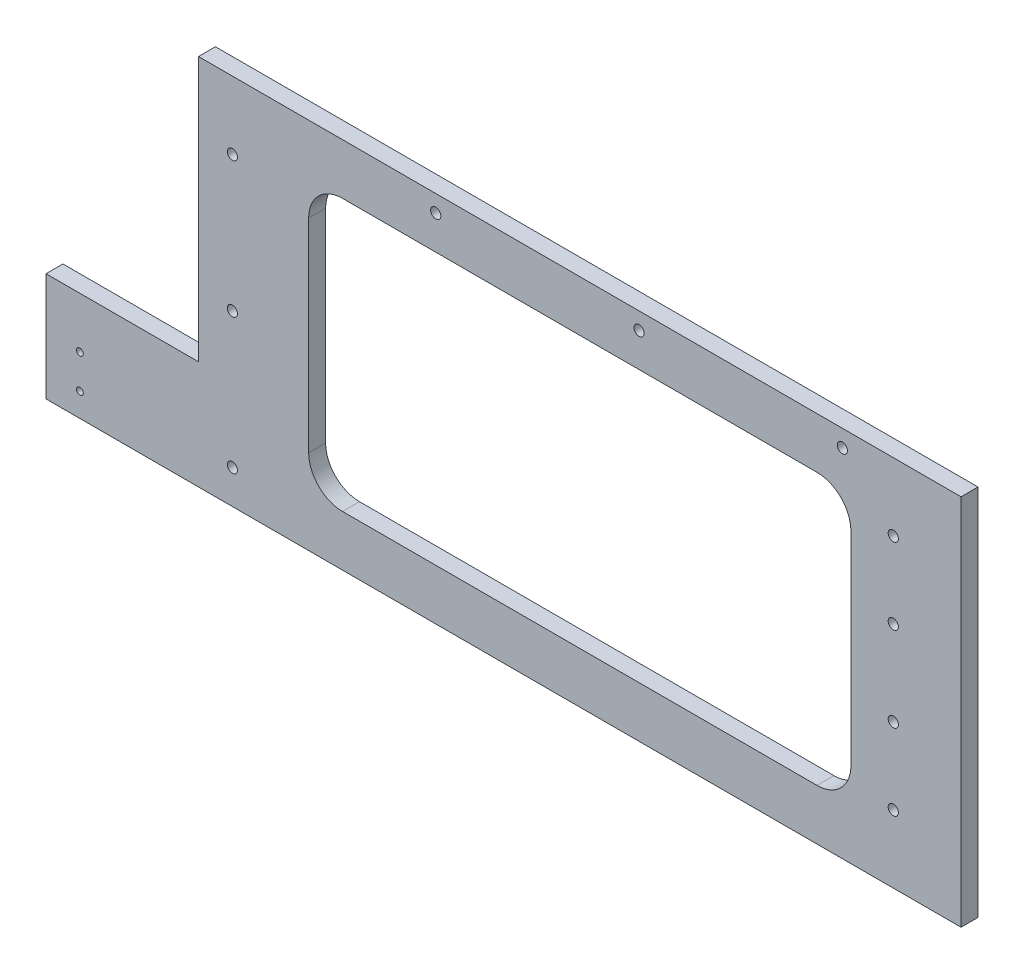
ISO-10303-21;
HEADER;
FILE_DESCRIPTION(('STEP AP214'),'2;1');
FILE_NAME('part.step','',(''),(''),'','','');
FILE_SCHEMA(('AUTOMOTIVE_DESIGN { 1 0 10303 214 1 1 1 1 }'));
ENDSEC;
DATA;
#1=APPLICATION_CONTEXT('core data for automotive mechanical design processes');
#2=APPLICATION_PROTOCOL_DEFINITION('international standard','automotive_design',2000,#1);
#3=PRODUCT_CONTEXT('',#1,'mechanical');
#4=PRODUCT('Part','Part','',(#3));
#5=PRODUCT_RELATED_PRODUCT_CATEGORY('part','',(#4));
#6=PRODUCT_DEFINITION_FORMATION('','',#4);
#7=PRODUCT_DEFINITION_CONTEXT('part definition',#1,'design');
#8=PRODUCT_DEFINITION('design','',#6,#7);
#9=PRODUCT_DEFINITION_SHAPE('','',#8);
#10=(LENGTH_UNIT() NAMED_UNIT(*) SI_UNIT(.MILLI.,.METRE.));
#11=(NAMED_UNIT(*) PLANE_ANGLE_UNIT() SI_UNIT($,.RADIAN.));
#12=(NAMED_UNIT(*) SI_UNIT($,.STERADIAN.) SOLID_ANGLE_UNIT());
#13=UNCERTAINTY_MEASURE_WITH_UNIT(LENGTH_MEASURE(1.E-05),#10,'distance_accuracy_value','');
#14=(GEOMETRIC_REPRESENTATION_CONTEXT(3) GLOBAL_UNCERTAINTY_ASSIGNED_CONTEXT((#13)) GLOBAL_UNIT_ASSIGNED_CONTEXT((#10,
#11,#12)) REPRESENTATION_CONTEXT('',''));
#15=CARTESIAN_POINT('',(0.,0.,0.));
#16=DIRECTION('',(0.,0.,1.));
#17=DIRECTION('',(1.,0.,0.));
#18=AXIS2_PLACEMENT_3D('',#15,#16,#17);
#19=CARTESIAN_POINT('',(0.,0.,5.));
#20=DIRECTION('',(0.,0.,1.));
#21=DIRECTION('',(1.,0.,0.));
#22=AXIS2_PLACEMENT_3D('',#19,#20,#21);
#23=PLANE('',#22);
#24=DIRECTION('',(0.,-1.,0.));
#25=VECTOR('',#24,1.);
#26=CARTESIAN_POINT('',(-80.,40.,5.));
#27=LINE('',#26,#25);
#28=CARTESIAN_POINT('',(-80.,30.,5.));
#29=VERTEX_POINT('',#28);
#30=CARTESIAN_POINT('',(-80.,-30.,5.));
#31=VERTEX_POINT('',#30);
#32=EDGE_CURVE('E234',#29,#31,#27,.T.);
#33=ORIENTED_EDGE('',*,*,#32,.F.);
#34=CARTESIAN_POINT('',(-70.,30.,5.));
#35=DIRECTION('',(0.,0.,1.));
#36=DIRECTION('',(1.,0.,0.));
#37=AXIS2_PLACEMENT_3D('',#34,#35,#36);
#38=CIRCLE('',#37,10.);
#39=CARTESIAN_POINT('',(-70.,40.,5.));
#40=VERTEX_POINT('',#39);
#41=EDGE_CURVE('E42',#29,#40,#38,.F.);
#42=ORIENTED_EDGE('',*,*,#41,.T.);
#43=DIRECTION('',(-1.,0.,0.));
#44=VECTOR('',#43,1.);
#45=CARTESIAN_POINT('',(-80.,40.,5.));
#46=LINE('',#45,#44);
#47=CARTESIAN_POINT('',(70.,40.,5.));
#48=VERTEX_POINT('',#47);
#49=EDGE_CURVE('E233',#48,#40,#46,.T.);
#50=ORIENTED_EDGE('',*,*,#49,.F.);
#51=CARTESIAN_POINT('',(70.,30.,5.));
#52=DIRECTION('',(0.,0.,1.));
#53=DIRECTION('',(1.,0.,0.));
#54=AXIS2_PLACEMENT_3D('',#51,#52,#53);
#55=CIRCLE('',#54,10.);
#56=CARTESIAN_POINT('',(80.,30.,5.));
#57=VERTEX_POINT('',#56);
#58=EDGE_CURVE('E217',#48,#57,#55,.F.);
#59=ORIENTED_EDGE('',*,*,#58,.T.);
#60=DIRECTION('',(0.,1.,0.));
#61=VECTOR('',#60,1.);
#62=CARTESIAN_POINT('',(80.,40.,5.));
#63=LINE('',#62,#61);
#64=CARTESIAN_POINT('',(80.,-30.,5.));
#65=VERTEX_POINT('',#64);
#66=EDGE_CURVE('E243',#65,#57,#63,.T.);
#67=ORIENTED_EDGE('',*,*,#66,.F.);
#68=CARTESIAN_POINT('',(70.,-30.,5.));
#69=DIRECTION('',(0.,0.,1.));
#70=DIRECTION('',(1.,0.,0.));
#71=AXIS2_PLACEMENT_3D('',#68,#69,#70);
#72=CIRCLE('',#71,10.);
#73=CARTESIAN_POINT('',(70.,-40.,5.));
#74=VERTEX_POINT('',#73);
#75=EDGE_CURVE('E221',#65,#74,#72,.F.);
#76=ORIENTED_EDGE('',*,*,#75,.T.);
#77=DIRECTION('',(1.,0.,0.));
#78=VECTOR('',#77,1.);
#79=CARTESIAN_POINT('',(-80.,-40.,5.));
#80=LINE('',#79,#78);
#81=CARTESIAN_POINT('',(-70.,-40.,5.));
#82=VERTEX_POINT('',#81);
#83=EDGE_CURVE('E259',#82,#74,#80,.T.);
#84=ORIENTED_EDGE('',*,*,#83,.F.);
#85=CARTESIAN_POINT('',(-70.,-30.,5.));
#86=DIRECTION('',(0.,0.,1.));
#87=DIRECTION('',(1.,0.,0.));
#88=AXIS2_PLACEMENT_3D('',#85,#86,#87);
#89=CIRCLE('',#88,10.);
#90=EDGE_CURVE('E225',#82,#31,#89,.F.);
#91=ORIENTED_EDGE('',*,*,#90,.T.);
#92=EDGE_LOOP('',(#33,#42,#50,#59,#67,#76,#84,#91));
#93=FACE_BOUND('',#92,.T.);
#94=CARTESIAN_POINT('',(-147.5,-38.,5.));
#95=DIRECTION('',(0.,0.,1.));
#96=DIRECTION('',(1.,0.,0.));
#97=AXIS2_PLACEMENT_3D('',#94,#95,#96);
#98=CIRCLE('',#97,0.999999999999998);
#99=CARTESIAN_POINT('',(-146.5,-38.,5.));
#100=VERTEX_POINT('',#99);
#101=EDGE_CURVE('E268',#100,#100,#98,.T.);
#102=ORIENTED_EDGE('',*,*,#101,.F.);
#103=EDGE_LOOP('',(#102));
#104=FACE_BOUND('',#103,.T.);
#105=CARTESIAN_POINT('',(-147.5,-48.,5.));
#106=DIRECTION('',(0.,0.,1.));
#107=DIRECTION('',(-1.,0.,0.));
#108=AXIS2_PLACEMENT_3D('',#105,#106,#107);
#109=CIRCLE('',#108,0.999999999999998);
#110=CARTESIAN_POINT('',(-148.5,-48.,5.));
#111=VERTEX_POINT('',#110);
#112=EDGE_CURVE('E257',#111,#111,#109,.T.);
#113=ORIENTED_EDGE('',*,*,#112,.F.);
#114=EDGE_LOOP('',(#113));
#115=FACE_BOUND('',#114,.T.);
#116=CARTESIAN_POINT('',(-102.499999999999,-45.,5.));
#117=DIRECTION('',(0.,0.,1.));
#118=DIRECTION('',(1.,0.,0.));
#119=AXIS2_PLACEMENT_3D('',#116,#117,#118);
#120=CIRCLE('',#119,1.5);
#121=CARTESIAN_POINT('',(-100.999999999999,-45.,5.));
#122=VERTEX_POINT('',#121);
#123=EDGE_CURVE('E267',#122,#122,#120,.T.);
#124=ORIENTED_EDGE('',*,*,#123,.F.);
#125=EDGE_LOOP('',(#124));
#126=FACE_BOUND('',#125,.T.);
#127=CARTESIAN_POINT('',(-102.5,35.,5.));
#128=DIRECTION('',(0.,0.,1.));
#129=DIRECTION('',(1.,0.,0.));
#130=AXIS2_PLACEMENT_3D('',#127,#128,#129);
#131=CIRCLE('',#130,1.5);
#132=CARTESIAN_POINT('',(-101.,35.,5.));
#133=VERTEX_POINT('',#132);
#134=EDGE_CURVE('E294',#133,#133,#131,.T.);
#135=ORIENTED_EDGE('',*,*,#134,.F.);
#136=EDGE_LOOP('',(#135));
#137=FACE_BOUND('',#136,.T.);
#138=CARTESIAN_POINT('',(17.5,50.,5.));
#139=DIRECTION('',(0.,0.,1.));
#140=DIRECTION('',(1.,0.,0.));
#141=AXIS2_PLACEMENT_3D('',#138,#139,#140);
#142=CIRCLE('',#141,1.5);
#143=CARTESIAN_POINT('',(19.,50.,5.));
#144=VERTEX_POINT('',#143);
#145=EDGE_CURVE('E279',#144,#144,#142,.T.);
#146=ORIENTED_EDGE('',*,*,#145,.F.);
#147=EDGE_LOOP('',(#146));
#148=FACE_BOUND('',#147,.T.);
#149=CARTESIAN_POINT('',(77.5,50.,5.));
#150=DIRECTION('',(0.,0.,1.));
#151=DIRECTION('',(1.,0.,0.));
#152=AXIS2_PLACEMENT_3D('',#149,#150,#151);
#153=CIRCLE('',#152,1.5);
#154=CARTESIAN_POINT('',(79.,50.,5.));
#155=VERTEX_POINT('',#154);
#156=EDGE_CURVE('E280',#155,#155,#153,.T.);
#157=ORIENTED_EDGE('',*,*,#156,.F.);
#158=EDGE_LOOP('',(#157));
#159=FACE_BOUND('',#158,.T.);
#160=CARTESIAN_POINT('',(-102.5,-4.99999999999998,5.));
#161=DIRECTION('',(0.,0.,1.));
#162=DIRECTION('',(1.,0.,0.));
#163=AXIS2_PLACEMENT_3D('',#160,#161,#162);
#164=CIRCLE('',#163,1.5);
#165=CARTESIAN_POINT('',(-101.,-4.99999999999998,5.));
#166=VERTEX_POINT('',#165);
#167=EDGE_CURVE('E286',#166,#166,#164,.T.);
#168=ORIENTED_EDGE('',*,*,#167,.F.);
#169=EDGE_LOOP('',(#168));
#170=FACE_BOUND('',#169,.T.);
#171=CARTESIAN_POINT('',(-42.5,50.,5.));
#172=DIRECTION('',(0.,0.,1.));
#173=DIRECTION('',(1.,0.,0.));
#174=AXIS2_PLACEMENT_3D('',#171,#172,#173);
#175=CIRCLE('',#174,1.5);
#176=CARTESIAN_POINT('',(-41.,50.,5.));
#177=VERTEX_POINT('',#176);
#178=EDGE_CURVE('E293',#177,#177,#175,.T.);
#179=ORIENTED_EDGE('',*,*,#178,.F.);
#180=EDGE_LOOP('',(#179));
#181=FACE_BOUND('',#180,.T.);
#182=CARTESIAN_POINT('',(92.5,12.5,5.));
#183=DIRECTION('',(0.,0.,-1.));
#184=DIRECTION('',(-1.,0.,0.));
#185=AXIS2_PLACEMENT_3D('',#182,#183,#184);
#186=CIRCLE('',#185,1.5);
#187=CARTESIAN_POINT('',(91.,12.5,5.));
#188=VERTEX_POINT('',#187);
#189=EDGE_CURVE('E316',#188,#188,#186,.T.);
#190=ORIENTED_EDGE('',*,*,#189,.T.);
#191=EDGE_LOOP('',(#190));
#192=FACE_BOUND('',#191,.T.);
#193=CARTESIAN_POINT('',(92.5,-35.,5.));
#194=DIRECTION('',(0.,0.,-1.));
#195=DIRECTION('',(-1.,0.,0.));
#196=AXIS2_PLACEMENT_3D('',#193,#194,#195);
#197=CIRCLE('',#196,1.5);
#198=CARTESIAN_POINT('',(91.,-35.,5.));
#199=VERTEX_POINT('',#198);
#200=EDGE_CURVE('E327',#199,#199,#197,.T.);
#201=ORIENTED_EDGE('',*,*,#200,.T.);
#202=EDGE_LOOP('',(#201));
#203=FACE_BOUND('',#202,.T.);
#204=DIRECTION('',(0.,-1.,0.));
#205=VECTOR('',#204,1.);
#206=CARTESIAN_POINT('',(-112.5,-55.,5.));
#207=LINE('',#206,#205);
#208=CARTESIAN_POINT('',(-112.5,55.,5.));
#209=VERTEX_POINT('',#208);
#210=CARTESIAN_POINT('',(-112.5,-23.,5.));
#211=VERTEX_POINT('',#210);
#212=EDGE_CURVE('E178',#209,#211,#207,.T.);
#213=ORIENTED_EDGE('',*,*,#212,.T.);
#214=DIRECTION('',(1.,0.,0.));
#215=VECTOR('',#214,1.);
#216=CARTESIAN_POINT('',(-157.5,-23.,5.));
#217=LINE('',#216,#215);
#218=CARTESIAN_POINT('',(-157.5,-23.,5.));
#219=VERTEX_POINT('',#218);
#220=EDGE_CURVE('E175',#219,#211,#217,.T.);
#221=ORIENTED_EDGE('',*,*,#220,.F.);
#222=DIRECTION('',(0.,1.,0.));
#223=VECTOR('',#222,1.);
#224=CARTESIAN_POINT('',(-157.5,-55.,5.));
#225=LINE('',#224,#223);
#226=CARTESIAN_POINT('',(-157.5,-55.,5.));
#227=VERTEX_POINT('',#226);
#228=EDGE_CURVE('E156',#227,#219,#225,.T.);
#229=ORIENTED_EDGE('',*,*,#228,.F.);
#230=DIRECTION('',(1.,0.,0.));
#231=VECTOR('',#230,1.);
#232=CARTESIAN_POINT('',(112.5,-55.,5.));
#233=LINE('',#232,#231);
#234=CARTESIAN_POINT('',(112.5,-55.,5.));
#235=VERTEX_POINT('',#234);
#236=EDGE_CURVE('E153',#227,#235,#233,.T.);
#237=ORIENTED_EDGE('',*,*,#236,.T.);
#238=DIRECTION('',(0.,1.,0.));
#239=VECTOR('',#238,1.);
#240=CARTESIAN_POINT('',(112.5,-55.,5.));
#241=LINE('',#240,#239);
#242=CARTESIAN_POINT('',(112.5,55.,5.));
#243=VERTEX_POINT('',#242);
#244=EDGE_CURVE('E183',#235,#243,#241,.T.);
#245=ORIENTED_EDGE('',*,*,#244,.T.);
#246=DIRECTION('',(-1.,0.,0.));
#247=VECTOR('',#246,1.);
#248=CARTESIAN_POINT('',(112.5,55.,5.));
#249=LINE('',#248,#247);
#250=EDGE_CURVE('E185',#243,#209,#249,.T.);
#251=ORIENTED_EDGE('',*,*,#250,.T.);
#252=EDGE_LOOP('',(#213,#221,#229,#237,#245,#251));
#253=FACE_BOUND('',#252,.T.);
#254=CARTESIAN_POINT('',(92.5,-12.5,5.));
#255=DIRECTION('',(0.,0.,1.));
#256=DIRECTION('',(1.,0.,0.));
#257=AXIS2_PLACEMENT_3D('',#254,#255,#256);
#258=CIRCLE('',#257,1.5);
#259=CARTESIAN_POINT('',(94.,-12.5,5.));
#260=VERTEX_POINT('',#259);
#261=EDGE_CURVE('E322',#260,#260,#258,.T.);
#262=ORIENTED_EDGE('',*,*,#261,.F.);
#263=EDGE_LOOP('',(#262));
#264=FACE_BOUND('',#263,.T.);
#265=CARTESIAN_POINT('',(92.5,35.,5.));
#266=DIRECTION('',(0.,0.,1.));
#267=DIRECTION('',(1.,0.,0.));
#268=AXIS2_PLACEMENT_3D('',#265,#266,#267);
#269=CIRCLE('',#268,1.5);
#270=CARTESIAN_POINT('',(94.,35.,5.));
#271=VERTEX_POINT('',#270);
#272=EDGE_CURVE('E313',#271,#271,#269,.T.);
#273=ORIENTED_EDGE('',*,*,#272,.F.);
#274=EDGE_LOOP('',(#273));
#275=FACE_BOUND('',#274,.T.);
#276=ADVANCED_FACE('F34',(#93,#104,#115,#126,#137,#148,#159,#170,#181,#192,#203,#253,#264,#275),
#23,.T.);
#277=CARTESIAN_POINT('',(0.,0.,0.));
#278=DIRECTION('',(0.,0.,1.));
#279=DIRECTION('',(1.,0.,0.));
#280=AXIS2_PLACEMENT_3D('',#277,#278,#279);
#281=PLANE('',#280);
#282=DIRECTION('',(0.,1.,0.));
#283=VECTOR('',#282,1.);
#284=CARTESIAN_POINT('',(80.,40.,0.));
#285=LINE('',#284,#283);
#286=CARTESIAN_POINT('',(80.,-30.,0.));
#287=VERTEX_POINT('',#286);
#288=CARTESIAN_POINT('',(80.,30.,0.));
#289=VERTEX_POINT('',#288);
#290=EDGE_CURVE('E250',#287,#289,#285,.T.);
#291=ORIENTED_EDGE('',*,*,#290,.T.);
#292=CARTESIAN_POINT('',(70.,30.,0.));
#293=DIRECTION('',(0.,0.,1.));
#294=DIRECTION('',(1.,0.,0.));
#295=AXIS2_PLACEMENT_3D('',#292,#293,#294);
#296=CIRCLE('',#295,10.);
#297=CARTESIAN_POINT('',(70.,40.,0.));
#298=VERTEX_POINT('',#297);
#299=EDGE_CURVE('E219',#289,#298,#296,.T.);
#300=ORIENTED_EDGE('',*,*,#299,.T.);
#301=DIRECTION('',(-1.,0.,0.));
#302=VECTOR('',#301,1.);
#303=CARTESIAN_POINT('',(-80.,40.,0.));
#304=LINE('',#303,#302);
#305=CARTESIAN_POINT('',(-70.,40.,0.));
#306=VERTEX_POINT('',#305);
#307=EDGE_CURVE('E255',#298,#306,#304,.T.);
#308=ORIENTED_EDGE('',*,*,#307,.T.);
#309=CARTESIAN_POINT('',(-70.,30.,0.));
#310=DIRECTION('',(0.,0.,1.));
#311=DIRECTION('',(1.,0.,0.));
#312=AXIS2_PLACEMENT_3D('',#309,#310,#311);
#313=CIRCLE('',#312,10.);
#314=CARTESIAN_POINT('',(-80.,30.,0.));
#315=VERTEX_POINT('',#314);
#316=EDGE_CURVE('E11',#306,#315,#313,.T.);
#317=ORIENTED_EDGE('',*,*,#316,.T.);
#318=DIRECTION('',(0.,-1.,0.));
#319=VECTOR('',#318,1.);
#320=CARTESIAN_POINT('',(-80.,40.,0.));
#321=LINE('',#320,#319);
#322=CARTESIAN_POINT('',(-80.,-30.,0.));
#323=VERTEX_POINT('',#322);
#324=EDGE_CURVE('E242',#315,#323,#321,.T.);
#325=ORIENTED_EDGE('',*,*,#324,.T.);
#326=CARTESIAN_POINT('',(-70.,-30.,0.));
#327=DIRECTION('',(0.,0.,1.));
#328=DIRECTION('',(1.,0.,0.));
#329=AXIS2_PLACEMENT_3D('',#326,#327,#328);
#330=CIRCLE('',#329,10.);
#331=CARTESIAN_POINT('',(-70.,-40.,0.));
#332=VERTEX_POINT('',#331);
#333=EDGE_CURVE('E227',#323,#332,#330,.T.);
#334=ORIENTED_EDGE('',*,*,#333,.T.);
#335=DIRECTION('',(1.,0.,0.));
#336=VECTOR('',#335,1.);
#337=CARTESIAN_POINT('',(-80.,-40.,0.));
#338=LINE('',#337,#336);
#339=CARTESIAN_POINT('',(70.,-40.,0.));
#340=VERTEX_POINT('',#339);
#341=EDGE_CURVE('E247',#332,#340,#338,.T.);
#342=ORIENTED_EDGE('',*,*,#341,.T.);
#343=CARTESIAN_POINT('',(70.,-30.,0.));
#344=DIRECTION('',(0.,0.,1.));
#345=DIRECTION('',(1.,0.,0.));
#346=AXIS2_PLACEMENT_3D('',#343,#344,#345);
#347=CIRCLE('',#346,10.);
#348=EDGE_CURVE('E223',#340,#287,#347,.T.);
#349=ORIENTED_EDGE('',*,*,#348,.T.);
#350=EDGE_LOOP('',(#291,#300,#308,#317,#325,#334,#342,#349));
#351=FACE_BOUND('',#350,.T.);
#352=CARTESIAN_POINT('',(-147.5,-38.,0.));
#353=DIRECTION('',(0.,0.,1.));
#354=DIRECTION('',(1.,0.,0.));
#355=AXIS2_PLACEMENT_3D('',#352,#353,#354);
#356=CIRCLE('',#355,0.999999999999998);
#357=CARTESIAN_POINT('',(-146.5,-38.,0.));
#358=VERTEX_POINT('',#357);
#359=EDGE_CURVE('E264',#358,#358,#356,.T.);
#360=ORIENTED_EDGE('',*,*,#359,.T.);
#361=EDGE_LOOP('',(#360));
#362=FACE_BOUND('',#361,.T.);
#363=CARTESIAN_POINT('',(-147.5,-48.,0.));
#364=DIRECTION('',(0.,0.,1.));
#365=DIRECTION('',(-1.,0.,0.));
#366=AXIS2_PLACEMENT_3D('',#363,#364,#365);
#367=CIRCLE('',#366,0.999999999999998);
#368=CARTESIAN_POINT('',(-148.5,-48.,0.));
#369=VERTEX_POINT('',#368);
#370=EDGE_CURVE('E271',#369,#369,#367,.T.);
#371=ORIENTED_EDGE('',*,*,#370,.T.);
#372=EDGE_LOOP('',(#371));
#373=FACE_BOUND('',#372,.T.);
#374=CARTESIAN_POINT('',(-102.499999999999,-45.,0.));
#375=DIRECTION('',(0.,0.,1.));
#376=DIRECTION('',(1.,0.,0.));
#377=AXIS2_PLACEMENT_3D('',#374,#375,#376);
#378=CIRCLE('',#377,1.5);
#379=CARTESIAN_POINT('',(-100.999999999999,-45.,0.));
#380=VERTEX_POINT('',#379);
#381=EDGE_CURVE('E289',#380,#380,#378,.T.);
#382=ORIENTED_EDGE('',*,*,#381,.T.);
#383=EDGE_LOOP('',(#382));
#384=FACE_BOUND('',#383,.T.);
#385=CARTESIAN_POINT('',(-102.5,35.,0.));
#386=DIRECTION('',(0.,0.,1.));
#387=DIRECTION('',(1.,0.,0.));
#388=AXIS2_PLACEMENT_3D('',#385,#386,#387);
#389=CIRCLE('',#388,1.5);
#390=CARTESIAN_POINT('',(-101.,35.,0.));
#391=VERTEX_POINT('',#390);
#392=EDGE_CURVE('E290',#391,#391,#389,.T.);
#393=ORIENTED_EDGE('',*,*,#392,.T.);
#394=EDGE_LOOP('',(#393));
#395=FACE_BOUND('',#394,.T.);
#396=CARTESIAN_POINT('',(17.5,50.,0.));
#397=DIRECTION('',(0.,0.,1.));
#398=DIRECTION('',(1.,0.,0.));
#399=AXIS2_PLACEMENT_3D('',#396,#397,#398);
#400=CIRCLE('',#399,1.5);
#401=CARTESIAN_POINT('',(19.,50.,0.));
#402=VERTEX_POINT('',#401);
#403=EDGE_CURVE('E297',#402,#402,#400,.T.);
#404=ORIENTED_EDGE('',*,*,#403,.T.);
#405=EDGE_LOOP('',(#404));
#406=FACE_BOUND('',#405,.T.);
#407=CARTESIAN_POINT('',(77.5,50.,0.));
#408=DIRECTION('',(0.,0.,1.));
#409=DIRECTION('',(1.,0.,0.));
#410=AXIS2_PLACEMENT_3D('',#407,#408,#409);
#411=CIRCLE('',#410,1.5);
#412=CARTESIAN_POINT('',(79.,50.,0.));
#413=VERTEX_POINT('',#412);
#414=EDGE_CURVE('E276',#413,#413,#411,.T.);
#415=ORIENTED_EDGE('',*,*,#414,.T.);
#416=EDGE_LOOP('',(#415));
#417=FACE_BOUND('',#416,.T.);
#418=CARTESIAN_POINT('',(-102.5,-4.99999999999998,0.));
#419=DIRECTION('',(0.,0.,1.));
#420=DIRECTION('',(1.,0.,0.));
#421=AXIS2_PLACEMENT_3D('',#418,#419,#420);
#422=CIRCLE('',#421,1.5);
#423=CARTESIAN_POINT('',(-101.,-4.99999999999998,0.));
#424=VERTEX_POINT('',#423);
#425=EDGE_CURVE('E283',#424,#424,#422,.T.);
#426=ORIENTED_EDGE('',*,*,#425,.T.);
#427=EDGE_LOOP('',(#426));
#428=FACE_BOUND('',#427,.T.);
#429=CARTESIAN_POINT('',(-42.5,50.,0.));
#430=DIRECTION('',(0.,0.,1.));
#431=DIRECTION('',(1.,0.,0.));
#432=AXIS2_PLACEMENT_3D('',#429,#430,#431);
#433=CIRCLE('',#432,1.5);
#434=CARTESIAN_POINT('',(-41.,50.,0.));
#435=VERTEX_POINT('',#434);
#436=EDGE_CURVE('E306',#435,#435,#433,.T.);
#437=ORIENTED_EDGE('',*,*,#436,.T.);
#438=EDGE_LOOP('',(#437));
#439=FACE_BOUND('',#438,.T.);
#440=CARTESIAN_POINT('',(92.5,-12.5,0.));
#441=DIRECTION('',(0.,0.,1.));
#442=DIRECTION('',(1.,0.,0.));
#443=AXIS2_PLACEMENT_3D('',#440,#441,#442);
#444=CIRCLE('',#443,1.5);
#445=CARTESIAN_POINT('',(94.,-12.5,0.));
#446=VERTEX_POINT('',#445);
#447=EDGE_CURVE('E325',#446,#446,#444,.T.);
#448=ORIENTED_EDGE('',*,*,#447,.T.);
#449=EDGE_LOOP('',(#448));
#450=FACE_BOUND('',#449,.T.);
#451=CARTESIAN_POINT('',(92.5,-35.,0.));
#452=DIRECTION('',(0.,0.,-1.));
#453=DIRECTION('',(-1.,0.,0.));
#454=AXIS2_PLACEMENT_3D('',#451,#452,#453);
#455=CIRCLE('',#454,1.5);
#456=CARTESIAN_POINT('',(91.,-35.,0.));
#457=VERTEX_POINT('',#456);
#458=EDGE_CURVE('E168',#457,#457,#455,.T.);
#459=ORIENTED_EDGE('',*,*,#458,.F.);
#460=EDGE_LOOP('',(#459));
#461=FACE_BOUND('',#460,.T.);
#462=DIRECTION('',(0.,-1.,0.));
#463=VECTOR('',#462,1.);
#464=CARTESIAN_POINT('',(-112.5,-55.,0.));
#465=LINE('',#464,#463);
#466=CARTESIAN_POINT('',(-112.5,55.,0.));
#467=VERTEX_POINT('',#466);
#468=CARTESIAN_POINT('',(-112.5,-23.,0.));
#469=VERTEX_POINT('',#468);
#470=EDGE_CURVE('E148',#467,#469,#465,.T.);
#471=ORIENTED_EDGE('',*,*,#470,.F.);
#472=DIRECTION('',(-1.,0.,0.));
#473=VECTOR('',#472,1.);
#474=CARTESIAN_POINT('',(112.5,55.,0.));
#475=LINE('',#474,#473);
#476=CARTESIAN_POINT('',(112.5,55.,0.));
#477=VERTEX_POINT('',#476);
#478=EDGE_CURVE('E181',#477,#467,#475,.T.);
#479=ORIENTED_EDGE('',*,*,#478,.F.);
#480=DIRECTION('',(0.,1.,0.));
#481=VECTOR('',#480,1.);
#482=CARTESIAN_POINT('',(112.5,-55.,0.));
#483=LINE('',#482,#481);
#484=CARTESIAN_POINT('',(112.5,-55.,0.));
#485=VERTEX_POINT('',#484);
#486=EDGE_CURVE('E144',#485,#477,#483,.T.);
#487=ORIENTED_EDGE('',*,*,#486,.F.);
#488=DIRECTION('',(1.,0.,0.));
#489=VECTOR('',#488,1.);
#490=CARTESIAN_POINT('',(112.5,-55.,0.));
#491=LINE('',#490,#489);
#492=CARTESIAN_POINT('',(-157.5,-55.,0.));
#493=VERTEX_POINT('',#492);
#494=EDGE_CURVE('E135',#493,#485,#491,.T.);
#495=ORIENTED_EDGE('',*,*,#494,.F.);
#496=DIRECTION('',(0.,-1.,0.));
#497=VECTOR('',#496,1.);
#498=CARTESIAN_POINT('',(-157.5,-55.,0.));
#499=LINE('',#498,#497);
#500=CARTESIAN_POINT('',(-157.5,-23.,0.));
#501=VERTEX_POINT('',#500);
#502=EDGE_CURVE('E142',#501,#493,#499,.T.);
#503=ORIENTED_EDGE('',*,*,#502,.F.);
#504=DIRECTION('',(1.,0.,0.));
#505=VECTOR('',#504,1.);
#506=CARTESIAN_POINT('',(-157.5,-23.,0.));
#507=LINE('',#506,#505);
#508=EDGE_CURVE('E172',#501,#469,#507,.T.);
#509=ORIENTED_EDGE('',*,*,#508,.T.);
#510=EDGE_LOOP('',(#471,#479,#487,#495,#503,#509));
#511=FACE_BOUND('',#510,.T.);
#512=CARTESIAN_POINT('',(92.5,12.5,0.));
#513=DIRECTION('',(0.,0.,-1.));
#514=DIRECTION('',(-1.,0.,0.));
#515=AXIS2_PLACEMENT_3D('',#512,#513,#514);
#516=CIRCLE('',#515,1.5);
#517=CARTESIAN_POINT('',(91.,12.5,0.));
#518=VERTEX_POINT('',#517);
#519=EDGE_CURVE('E319',#518,#518,#516,.T.);
#520=ORIENTED_EDGE('',*,*,#519,.F.);
#521=EDGE_LOOP('',(#520));
#522=FACE_BOUND('',#521,.T.);
#523=CARTESIAN_POINT('',(92.5,35.,0.));
#524=DIRECTION('',(0.,0.,1.));
#525=DIRECTION('',(1.,0.,0.));
#526=AXIS2_PLACEMENT_3D('',#523,#524,#525);
#527=CIRCLE('',#526,1.5);
#528=CARTESIAN_POINT('',(94.,35.,0.));
#529=VERTEX_POINT('',#528);
#530=EDGE_CURVE('E165',#529,#529,#527,.T.);
#531=ORIENTED_EDGE('',*,*,#530,.T.);
#532=EDGE_LOOP('',(#531));
#533=FACE_BOUND('',#532,.T.);
#534=ADVANCED_FACE('F138',(#351,#362,#373,#384,#395,#406,#417,#428,#439,#450,#461,#511,#522,
#533),#281,.F.);
#535=CARTESIAN_POINT('',(-112.5,-55.,5.));
#536=DIRECTION('',(1.,0.,0.));
#537=DIRECTION('',(0.,0.,-1.));
#538=AXIS2_PLACEMENT_3D('',#535,#536,#537);
#539=PLANE('',#538);
#540=DIRECTION('',(0.,0.,-1.));
#541=VECTOR('',#540,1.);
#542=CARTESIAN_POINT('',(-112.5,-23.,0.));
#543=LINE('',#542,#541);
#544=EDGE_CURVE('E162',#211,#469,#543,.T.);
#545=ORIENTED_EDGE('',*,*,#544,.F.);
#546=ORIENTED_EDGE('',*,*,#212,.F.);
#547=DIRECTION('',(0.,0.,-1.));
#548=VECTOR('',#547,1.);
#549=CARTESIAN_POINT('',(-112.5,55.,5.));
#550=LINE('',#549,#548);
#551=EDGE_CURVE('E187',#209,#467,#550,.T.);
#552=ORIENTED_EDGE('',*,*,#551,.T.);
#553=ORIENTED_EDGE('',*,*,#470,.T.);
#554=EDGE_LOOP('',(#545,#546,#552,#553));
#555=FACE_BOUND('',#554,.T.);
#556=ADVANCED_FACE('F338',(#555),#539,.F.);
#557=CARTESIAN_POINT('',(112.5,-55.,5.));
#558=DIRECTION('',(0.,1.,0.));
#559=DIRECTION('',(-1.,0.,0.));
#560=AXIS2_PLACEMENT_3D('',#557,#558,#559);
#561=PLANE('',#560);
#562=ORIENTED_EDGE('',*,*,#494,.T.);
#563=DIRECTION('',(0.,0.,-1.));
#564=VECTOR('',#563,1.);
#565=CARTESIAN_POINT('',(112.5,-55.,5.));
#566=LINE('',#565,#564);
#567=EDGE_CURVE('E196',#235,#485,#566,.T.);
#568=ORIENTED_EDGE('',*,*,#567,.F.);
#569=ORIENTED_EDGE('',*,*,#236,.F.);
#570=DIRECTION('',(0.,0.,1.));
#571=VECTOR('',#570,1.);
#572=CARTESIAN_POINT('',(-157.5,-55.,0.));
#573=LINE('',#572,#571);
#574=EDGE_CURVE('E151',#493,#227,#573,.T.);
#575=ORIENTED_EDGE('',*,*,#574,.F.);
#576=EDGE_LOOP('',(#562,#568,#569,#575));
#577=FACE_BOUND('',#576,.T.);
#578=ADVANCED_FACE('F152',(#577),#561,.F.);
#579=CARTESIAN_POINT('',(112.5,-55.,5.));
#580=DIRECTION('',(-1.,0.,0.));
#581=DIRECTION('',(0.,0.,1.));
#582=AXIS2_PLACEMENT_3D('',#579,#580,#581);
#583=PLANE('',#582);
#584=ORIENTED_EDGE('',*,*,#486,.T.);
#585=DIRECTION('',(0.,0.,-1.));
#586=VECTOR('',#585,1.);
#587=CARTESIAN_POINT('',(112.5,55.,5.));
#588=LINE('',#587,#586);
#589=EDGE_CURVE('E193',#243,#477,#588,.T.);
#590=ORIENTED_EDGE('',*,*,#589,.F.);
#591=ORIENTED_EDGE('',*,*,#244,.F.);
#592=ORIENTED_EDGE('',*,*,#567,.T.);
#593=EDGE_LOOP('',(#584,#590,#591,#592));
#594=FACE_BOUND('',#593,.T.);
#595=ADVANCED_FACE('F354',(#594),#583,.F.);
#596=CARTESIAN_POINT('',(112.5,55.,5.));
#597=DIRECTION('',(0.,-1.,0.));
#598=DIRECTION('',(1.,0.,0.));
#599=AXIS2_PLACEMENT_3D('',#596,#597,#598);
#600=PLANE('',#599);
#601=ORIENTED_EDGE('',*,*,#478,.T.);
#602=ORIENTED_EDGE('',*,*,#551,.F.);
#603=ORIENTED_EDGE('',*,*,#250,.F.);
#604=ORIENTED_EDGE('',*,*,#589,.T.);
#605=EDGE_LOOP('',(#601,#602,#603,#604));
#606=FACE_BOUND('',#605,.T.);
#607=ADVANCED_FACE('F350',(#606),#600,.F.);
#608=CARTESIAN_POINT('',(-157.5,-23.,0.));
#609=DIRECTION('',(0.,-1.,0.));
#610=DIRECTION('',(0.,0.,-1.));
#611=AXIS2_PLACEMENT_3D('',#608,#609,#610);
#612=PLANE('',#611);
#613=ORIENTED_EDGE('',*,*,#544,.T.);
#614=ORIENTED_EDGE('',*,*,#508,.F.);
#615=DIRECTION('',(0.,0.,-1.));
#616=VECTOR('',#615,1.);
#617=CARTESIAN_POINT('',(-157.5,-23.,0.));
#618=LINE('',#617,#616);
#619=EDGE_CURVE('E160',#219,#501,#618,.T.);
#620=ORIENTED_EDGE('',*,*,#619,.F.);
#621=ORIENTED_EDGE('',*,*,#220,.T.);
#622=EDGE_LOOP('',(#613,#614,#620,#621));
#623=FACE_BOUND('',#622,.T.);
#624=ADVANCED_FACE('F353',(#623),#612,.F.);
#625=CARTESIAN_POINT('',(-157.5,0.,0.));
#626=DIRECTION('',(1.,0.,0.));
#627=DIRECTION('',(0.,0.,-1.));
#628=AXIS2_PLACEMENT_3D('',#625,#626,#627);
#629=PLANE('',#628);
#630=ORIENTED_EDGE('',*,*,#502,.T.);
#631=ORIENTED_EDGE('',*,*,#574,.T.);
#632=ORIENTED_EDGE('',*,*,#228,.T.);
#633=ORIENTED_EDGE('',*,*,#619,.T.);
#634=EDGE_LOOP('',(#630,#631,#632,#633));
#635=FACE_BOUND('',#634,.T.);
#636=ADVANCED_FACE('F158',(#635),#629,.F.);
#637=CARTESIAN_POINT('',(92.5,-35.,0.));
#638=DIRECTION('',(0.,0.,1.));
#639=DIRECTION('',(1.,0.,0.));
#640=AXIS2_PLACEMENT_3D('',#637,#638,#639);
#641=CYLINDRICAL_SURFACE('',#640,1.5);
#642=ORIENTED_EDGE('',*,*,#458,.T.);
#643=EDGE_LOOP('',(#642));
#644=FACE_BOUND('',#643,.T.);
#645=ORIENTED_EDGE('',*,*,#200,.F.);
#646=EDGE_LOOP('',(#645));
#647=FACE_BOUND('',#646,.T.);
#648=ADVANCED_FACE('F334',(#644,#647),#641,.F.);
#649=CARTESIAN_POINT('',(92.5,-12.5,0.));
#650=DIRECTION('',(0.,0.,1.));
#651=DIRECTION('',(1.,0.,0.));
#652=AXIS2_PLACEMENT_3D('',#649,#650,#651);
#653=CYLINDRICAL_SURFACE('',#652,1.5);
#654=ORIENTED_EDGE('',*,*,#447,.F.);
#655=EDGE_LOOP('',(#654));
#656=FACE_BOUND('',#655,.T.);
#657=ORIENTED_EDGE('',*,*,#261,.T.);
#658=EDGE_LOOP('',(#657));
#659=FACE_BOUND('',#658,.T.);
#660=ADVANCED_FACE('F438',(#656,#659),#653,.F.);
#661=CARTESIAN_POINT('',(92.5,12.5,0.));
#662=DIRECTION('',(0.,0.,1.));
#663=DIRECTION('',(1.,0.,0.));
#664=AXIS2_PLACEMENT_3D('',#661,#662,#663);
#665=CYLINDRICAL_SURFACE('',#664,1.5);
#666=ORIENTED_EDGE('',*,*,#519,.T.);
#667=EDGE_LOOP('',(#666));
#668=FACE_BOUND('',#667,.T.);
#669=ORIENTED_EDGE('',*,*,#189,.F.);
#670=EDGE_LOOP('',(#669));
#671=FACE_BOUND('',#670,.T.);
#672=ADVANCED_FACE('F434',(#668,#671),#665,.F.);
#673=CARTESIAN_POINT('',(92.5,35.,0.));
#674=DIRECTION('',(0.,0.,1.));
#675=DIRECTION('',(1.,0.,0.));
#676=AXIS2_PLACEMENT_3D('',#673,#674,#675);
#677=CYLINDRICAL_SURFACE('',#676,1.5);
#678=ORIENTED_EDGE('',*,*,#530,.F.);
#679=EDGE_LOOP('',(#678));
#680=FACE_BOUND('',#679,.T.);
#681=ORIENTED_EDGE('',*,*,#272,.T.);
#682=EDGE_LOOP('',(#681));
#683=FACE_BOUND('',#682,.T.);
#684=ADVANCED_FACE('F430',(#680,#683),#677,.F.);
#685=CARTESIAN_POINT('',(-42.5,50.,0.));
#686=DIRECTION('',(0.,0.,1.));
#687=DIRECTION('',(1.,0.,0.));
#688=AXIS2_PLACEMENT_3D('',#685,#686,#687);
#689=CYLINDRICAL_SURFACE('',#688,1.5);
#690=ORIENTED_EDGE('',*,*,#436,.F.);
#691=EDGE_LOOP('',(#690));
#692=FACE_BOUND('',#691,.T.);
#693=ORIENTED_EDGE('',*,*,#178,.T.);
#694=EDGE_LOOP('',(#693));
#695=FACE_BOUND('',#694,.T.);
#696=ADVANCED_FACE('F416',(#692,#695),#689,.F.);
#697=CARTESIAN_POINT('',(-102.5,-4.99999999999998,0.));
#698=DIRECTION('',(0.,0.,1.));
#699=DIRECTION('',(1.,0.,0.));
#700=AXIS2_PLACEMENT_3D('',#697,#698,#699);
#701=CYLINDRICAL_SURFACE('',#700,1.5);
#702=ORIENTED_EDGE('',*,*,#425,.F.);
#703=EDGE_LOOP('',(#702));
#704=FACE_BOUND('',#703,.T.);
#705=ORIENTED_EDGE('',*,*,#167,.T.);
#706=EDGE_LOOP('',(#705));
#707=FACE_BOUND('',#706,.T.);
#708=ADVANCED_FACE('F412',(#704,#707),#701,.F.);
#709=CARTESIAN_POINT('',(77.5,50.,0.));
#710=DIRECTION('',(0.,0.,1.));
#711=DIRECTION('',(1.,0.,0.));
#712=AXIS2_PLACEMENT_3D('',#709,#710,#711);
#713=CYLINDRICAL_SURFACE('',#712,1.5);
#714=ORIENTED_EDGE('',*,*,#414,.F.);
#715=EDGE_LOOP('',(#714));
#716=FACE_BOUND('',#715,.T.);
#717=ORIENTED_EDGE('',*,*,#156,.T.);
#718=EDGE_LOOP('',(#717));
#719=FACE_BOUND('',#718,.T.);
#720=ADVANCED_FACE('F408',(#716,#719),#713,.F.);
#721=CARTESIAN_POINT('',(17.5,50.,0.));
#722=DIRECTION('',(0.,0.,1.));
#723=DIRECTION('',(1.,0.,0.));
#724=AXIS2_PLACEMENT_3D('',#721,#722,#723);
#725=CYLINDRICAL_SURFACE('',#724,1.5);
#726=ORIENTED_EDGE('',*,*,#403,.F.);
#727=EDGE_LOOP('',(#726));
#728=FACE_BOUND('',#727,.T.);
#729=ORIENTED_EDGE('',*,*,#145,.T.);
#730=EDGE_LOOP('',(#729));
#731=FACE_BOUND('',#730,.T.);
#732=ADVANCED_FACE('F411',(#728,#731),#725,.F.);
#733=CARTESIAN_POINT('',(-102.5,35.,0.));
#734=DIRECTION('',(0.,0.,1.));
#735=DIRECTION('',(1.,0.,0.));
#736=AXIS2_PLACEMENT_3D('',#733,#734,#735);
#737=CYLINDRICAL_SURFACE('',#736,1.5);
#738=ORIENTED_EDGE('',*,*,#392,.F.);
#739=EDGE_LOOP('',(#738));
#740=FACE_BOUND('',#739,.T.);
#741=ORIENTED_EDGE('',*,*,#134,.T.);
#742=EDGE_LOOP('',(#741));
#743=FACE_BOUND('',#742,.T.);
#744=ADVANCED_FACE('F418',(#740,#743),#737,.F.);
#745=CARTESIAN_POINT('',(-102.499999999999,-45.,0.));
#746=DIRECTION('',(0.,0.,1.));
#747=DIRECTION('',(1.,0.,0.));
#748=AXIS2_PLACEMENT_3D('',#745,#746,#747);
#749=CYLINDRICAL_SURFACE('',#748,1.5);
#750=ORIENTED_EDGE('',*,*,#381,.F.);
#751=EDGE_LOOP('',(#750));
#752=FACE_BOUND('',#751,.T.);
#753=ORIENTED_EDGE('',*,*,#123,.T.);
#754=EDGE_LOOP('',(#753));
#755=FACE_BOUND('',#754,.T.);
#756=ADVANCED_FACE('F406',(#752,#755),#749,.F.);
#757=CARTESIAN_POINT('',(-147.5,-48.,0.));
#758=DIRECTION('',(0.,0.,1.));
#759=DIRECTION('',(1.,0.,0.));
#760=AXIS2_PLACEMENT_3D('',#757,#758,#759);
#761=CYLINDRICAL_SURFACE('',#760,0.999999999999998);
#762=ORIENTED_EDGE('',*,*,#370,.F.);
#763=EDGE_LOOP('',(#762));
#764=FACE_BOUND('',#763,.T.);
#765=ORIENTED_EDGE('',*,*,#112,.T.);
#766=EDGE_LOOP('',(#765));
#767=FACE_BOUND('',#766,.T.);
#768=ADVANCED_FACE('F402',(#764,#767),#761,.F.);
#769=CARTESIAN_POINT('',(-147.5,-38.,0.));
#770=DIRECTION('',(0.,0.,1.));
#771=DIRECTION('',(1.,0.,0.));
#772=AXIS2_PLACEMENT_3D('',#769,#770,#771);
#773=CYLINDRICAL_SURFACE('',#772,0.999999999999998);
#774=ORIENTED_EDGE('',*,*,#359,.F.);
#775=EDGE_LOOP('',(#774));
#776=FACE_BOUND('',#775,.T.);
#777=ORIENTED_EDGE('',*,*,#101,.T.);
#778=EDGE_LOOP('',(#777));
#779=FACE_BOUND('',#778,.T.);
#780=ADVANCED_FACE('F399',(#776,#779),#773,.F.);
#781=CARTESIAN_POINT('',(-80.,40.,0.));
#782=DIRECTION('',(-1.,0.,0.));
#783=DIRECTION('',(0.,-1.,0.));
#784=AXIS2_PLACEMENT_3D('',#781,#782,#783);
#785=PLANE('',#784);
#786=ORIENTED_EDGE('',*,*,#32,.T.);
#787=DIRECTION('',(0.,0.,1.));
#788=VECTOR('',#787,1.);
#789=CARTESIAN_POINT('',(-80.,-30.,0.));
#790=LINE('',#789,#788);
#791=EDGE_CURVE('E49',#31,#323,#790,.F.);
#792=ORIENTED_EDGE('',*,*,#791,.T.);
#793=ORIENTED_EDGE('',*,*,#324,.F.);
#794=DIRECTION('',(0.,0.,1.));
#795=VECTOR('',#794,1.);
#796=CARTESIAN_POINT('',(-80.,30.,5.));
#797=LINE('',#796,#795);
#798=EDGE_CURVE('E213',#315,#29,#797,.T.);
#799=ORIENTED_EDGE('',*,*,#798,.T.);
#800=EDGE_LOOP('',(#786,#792,#793,#799));
#801=FACE_BOUND('',#800,.T.);
#802=ADVANCED_FACE('F245',(#801),#785,.F.);
#803=CARTESIAN_POINT('',(-80.,40.,0.));
#804=DIRECTION('',(0.,1.,0.));
#805=DIRECTION('',(0.,0.,1.));
#806=AXIS2_PLACEMENT_3D('',#803,#804,#805);
#807=PLANE('',#806);
#808=ORIENTED_EDGE('',*,*,#307,.F.);
#809=DIRECTION('',(0.,0.,1.));
#810=VECTOR('',#809,1.);
#811=CARTESIAN_POINT('',(70.,40.,5.));
#812=LINE('',#811,#810);
#813=EDGE_CURVE('E200',#298,#48,#812,.T.);
#814=ORIENTED_EDGE('',*,*,#813,.T.);
#815=ORIENTED_EDGE('',*,*,#49,.T.);
#816=DIRECTION('',(0.,0.,1.));
#817=VECTOR('',#816,1.);
#818=CARTESIAN_POINT('',(-70.,40.,0.));
#819=LINE('',#818,#817);
#820=EDGE_CURVE('E198',#40,#306,#819,.F.);
#821=ORIENTED_EDGE('',*,*,#820,.T.);
#822=EDGE_LOOP('',(#808,#814,#815,#821));
#823=FACE_BOUND('',#822,.T.);
#824=ADVANCED_FACE('F240',(#823),#807,.F.);
#825=CARTESIAN_POINT('',(80.,40.,0.));
#826=DIRECTION('',(1.,0.,0.));
#827=DIRECTION('',(0.,1.,0.));
#828=AXIS2_PLACEMENT_3D('',#825,#826,#827);
#829=PLANE('',#828);
#830=ORIENTED_EDGE('',*,*,#66,.T.);
#831=DIRECTION('',(0.,0.,1.));
#832=VECTOR('',#831,1.);
#833=CARTESIAN_POINT('',(80.,30.,0.));
#834=LINE('',#833,#832);
#835=EDGE_CURVE('E206',#57,#289,#834,.F.);
#836=ORIENTED_EDGE('',*,*,#835,.T.);
#837=ORIENTED_EDGE('',*,*,#290,.F.);
#838=DIRECTION('',(0.,0.,1.));
#839=VECTOR('',#838,1.);
#840=CARTESIAN_POINT('',(80.,-30.,5.));
#841=LINE('',#840,#839);
#842=EDGE_CURVE('E203',#287,#65,#841,.T.);
#843=ORIENTED_EDGE('',*,*,#842,.T.);
#844=EDGE_LOOP('',(#830,#836,#837,#843));
#845=FACE_BOUND('',#844,.T.);
#846=ADVANCED_FACE('F385',(#845),#829,.F.);
#847=CARTESIAN_POINT('',(-80.,-40.,0.));
#848=DIRECTION('',(0.,-1.,0.));
#849=DIRECTION('',(0.,0.,-1.));
#850=AXIS2_PLACEMENT_3D('',#847,#848,#849);
#851=PLANE('',#850);
#852=ORIENTED_EDGE('',*,*,#83,.T.);
#853=DIRECTION('',(0.,0.,1.));
#854=VECTOR('',#853,1.);
#855=CARTESIAN_POINT('',(70.,-40.,0.));
#856=LINE('',#855,#854);
#857=EDGE_CURVE('E211',#74,#340,#856,.F.);
#858=ORIENTED_EDGE('',*,*,#857,.T.);
#859=ORIENTED_EDGE('',*,*,#341,.F.);
#860=DIRECTION('',(0.,0.,1.));
#861=VECTOR('',#860,1.);
#862=CARTESIAN_POINT('',(-70.,-40.,5.));
#863=LINE('',#862,#861);
#864=EDGE_CURVE('E208',#332,#82,#863,.T.);
#865=ORIENTED_EDGE('',*,*,#864,.T.);
#866=EDGE_LOOP('',(#852,#858,#859,#865));
#867=FACE_BOUND('',#866,.T.);
#868=ADVANCED_FACE('F365',(#867),#851,.F.);
#869=CARTESIAN_POINT('',(70.,30.,0.));
#870=DIRECTION('',(0.,0.,-1.));
#871=DIRECTION('',(-1.,0.,0.));
#872=AXIS2_PLACEMENT_3D('',#869,#870,#871);
#873=CYLINDRICAL_SURFACE('',#872,10.);
#874=ORIENTED_EDGE('',*,*,#299,.F.);
#875=ORIENTED_EDGE('',*,*,#835,.F.);
#876=ORIENTED_EDGE('',*,*,#58,.F.);
#877=ORIENTED_EDGE('',*,*,#813,.F.);
#878=EDGE_LOOP('',(#874,#875,#876,#877));
#879=FACE_BOUND('',#878,.T.);
#880=ADVANCED_FACE('F361',(#879),#873,.F.);
#881=CARTESIAN_POINT('',(70.,-30.,0.));
#882=DIRECTION('',(0.,0.,-1.));
#883=DIRECTION('',(-1.,0.,0.));
#884=AXIS2_PLACEMENT_3D('',#881,#882,#883);
#885=CYLINDRICAL_SURFACE('',#884,10.);
#886=ORIENTED_EDGE('',*,*,#348,.F.);
#887=ORIENTED_EDGE('',*,*,#857,.F.);
#888=ORIENTED_EDGE('',*,*,#75,.F.);
#889=ORIENTED_EDGE('',*,*,#842,.F.);
#890=EDGE_LOOP('',(#886,#887,#888,#889));
#891=FACE_BOUND('',#890,.T.);
#892=ADVANCED_FACE('F364',(#891),#885,.F.);
#893=CARTESIAN_POINT('',(-70.,-30.,0.));
#894=DIRECTION('',(0.,0.,-1.));
#895=DIRECTION('',(-1.,0.,0.));
#896=AXIS2_PLACEMENT_3D('',#893,#894,#895);
#897=CYLINDRICAL_SURFACE('',#896,10.);
#898=ORIENTED_EDGE('',*,*,#333,.F.);
#899=ORIENTED_EDGE('',*,*,#791,.F.);
#900=ORIENTED_EDGE('',*,*,#90,.F.);
#901=ORIENTED_EDGE('',*,*,#864,.F.);
#902=EDGE_LOOP('',(#898,#899,#900,#901));
#903=FACE_BOUND('',#902,.T.);
#904=ADVANCED_FACE('F368',(#903),#897,.F.);
#905=CARTESIAN_POINT('',(-70.,30.,0.));
#906=DIRECTION('',(0.,0.,-1.));
#907=DIRECTION('',(-1.,0.,0.));
#908=AXIS2_PLACEMENT_3D('',#905,#906,#907);
#909=CYLINDRICAL_SURFACE('',#908,10.);
#910=ORIENTED_EDGE('',*,*,#316,.F.);
#911=ORIENTED_EDGE('',*,*,#820,.F.);
#912=ORIENTED_EDGE('',*,*,#41,.F.);
#913=ORIENTED_EDGE('',*,*,#798,.F.);
#914=EDGE_LOOP('',(#910,#911,#912,#913));
#915=FACE_BOUND('',#914,.T.);
#916=ADVANCED_FACE('F36',(#915),#909,.F.);
#917=CLOSED_SHELL('',(#276,#534,#556,#578,#595,#607,#624,#636,#648,#660,#672,#684,#696,#708,
#720,#732,#744,#756,#768,#780,#802,#824,#846,#868,#880,#892,#904,#916));
#918=MANIFOLD_SOLID_BREP('B2',#917);
#919=ADVANCED_BREP_SHAPE_REPRESENTATION('',(#18,#918),#14);
#920=SHAPE_DEFINITION_REPRESENTATION(#9,#919);
ENDSEC;
END-ISO-10303-21;
